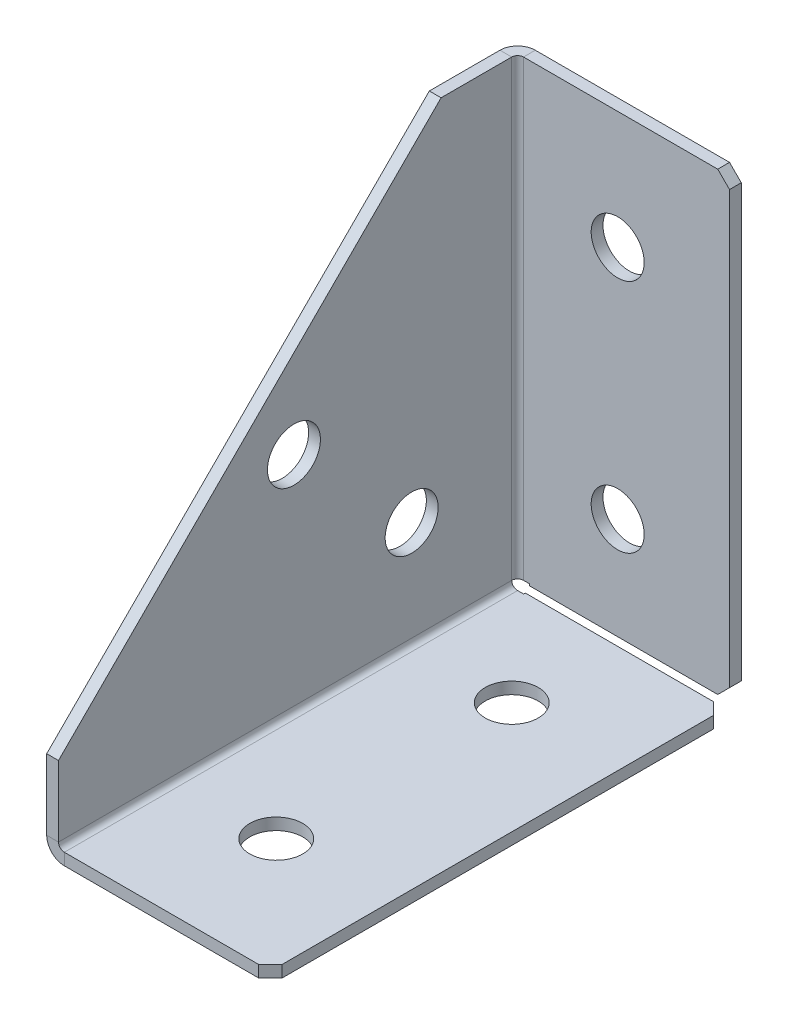
ISO-10303-21;
HEADER;
FILE_DESCRIPTION(('STEP AP214'),'2;1');
FILE_NAME('part.step','',(''),(''),'','','');
FILE_SCHEMA(('AUTOMOTIVE_DESIGN { 1 0 10303 214 1 1 1 1 }'));
ENDSEC;
DATA;
#1=APPLICATION_CONTEXT('core data for automotive mechanical design processes');
#2=APPLICATION_PROTOCOL_DEFINITION('international standard','automotive_design',2000,#1);
#3=PRODUCT_CONTEXT('',#1,'mechanical');
#4=PRODUCT('Part','Part','',(#3));
#5=PRODUCT_RELATED_PRODUCT_CATEGORY('part','',(#4));
#6=PRODUCT_DEFINITION_FORMATION('','',#4);
#7=PRODUCT_DEFINITION_CONTEXT('part definition',#1,'design');
#8=PRODUCT_DEFINITION('design','',#6,#7);
#9=PRODUCT_DEFINITION_SHAPE('','',#8);
#10=(LENGTH_UNIT() NAMED_UNIT(*) SI_UNIT(.MILLI.,.METRE.));
#11=(NAMED_UNIT(*) PLANE_ANGLE_UNIT() SI_UNIT($,.RADIAN.));
#12=(NAMED_UNIT(*) SI_UNIT($,.STERADIAN.) SOLID_ANGLE_UNIT());
#13=UNCERTAINTY_MEASURE_WITH_UNIT(LENGTH_MEASURE(1.E-05),#10,'distance_accuracy_value','');
#14=(GEOMETRIC_REPRESENTATION_CONTEXT(3) GLOBAL_UNCERTAINTY_ASSIGNED_CONTEXT((#13)) GLOBAL_UNIT_ASSIGNED_CONTEXT((#10,
#11,#12)) REPRESENTATION_CONTEXT('',''));
#15=CARTESIAN_POINT('',(0.,0.,0.));
#16=DIRECTION('',(0.,0.,1.));
#17=DIRECTION('',(1.,0.,0.));
#18=AXIS2_PLACEMENT_3D('',#15,#16,#17);
#19=CARTESIAN_POINT('',(3.,3.,2.99999999999998));
#20=DIRECTION('',(0.,0.,1.));
#21=DIRECTION('',(1.,0.,0.));
#22=AXIS2_PLACEMENT_3D('',#19,#20,#21);
#23=PLANE('',#22);
#24=DIRECTION('',(-1.,0.,0.));
#25=VECTOR('',#24,1.);
#26=CARTESIAN_POINT('',(0.,2.99999999999998,2.99999999999998));
#27=LINE('',#26,#25);
#28=CARTESIAN_POINT('',(2.,2.99999999999998,2.99999999999999));
#29=VERTEX_POINT('',#28);
#30=CARTESIAN_POINT('',(0.,2.99999999999998,2.99999999999998));
#31=VERTEX_POINT('',#30);
#32=EDGE_CURVE('E402',#29,#31,#27,.T.);
#33=ORIENTED_EDGE('',*,*,#32,.F.);
#34=CARTESIAN_POINT('',(3.,3.,2.99999999999998));
#35=DIRECTION('',(0.,0.,-1.));
#36=DIRECTION('',(-1.,0.,0.));
#37=AXIS2_PLACEMENT_3D('',#34,#35,#36);
#38=CIRCLE('',#37,1.);
#39=CARTESIAN_POINT('',(3.,2.,2.99999999999998));
#40=VERTEX_POINT('',#39);
#41=EDGE_CURVE('E347',#29,#40,#38,.F.);
#42=ORIENTED_EDGE('',*,*,#41,.T.);
#43=DIRECTION('',(0.,-1.,0.));
#44=VECTOR('',#43,1.);
#45=CARTESIAN_POINT('',(3.,0.,2.99999999999998));
#46=LINE('',#45,#44);
#47=CARTESIAN_POINT('',(3.,0.,2.99999999999998));
#48=VERTEX_POINT('',#47);
#49=EDGE_CURVE('E399',#40,#48,#46,.T.);
#50=ORIENTED_EDGE('',*,*,#49,.T.);
#51=CARTESIAN_POINT('',(3.,3.,2.99999999999998));
#52=DIRECTION('',(0.,0.,-1.));
#53=DIRECTION('',(-1.,0.,0.));
#54=AXIS2_PLACEMENT_3D('',#51,#52,#53);
#55=CIRCLE('',#54,3.);
#56=EDGE_CURVE('E286',#31,#48,#55,.F.);
#57=ORIENTED_EDGE('',*,*,#56,.F.);
#58=EDGE_LOOP('',(#33,#42,#50,#57));
#59=FACE_BOUND('',#58,.T.);
#60=ADVANCED_FACE('F48',(#59),#23,.F.);
#61=CARTESIAN_POINT('',(38.,0.,2.99999999999998));
#62=DIRECTION('',(0.,0.,1.));
#63=DIRECTION('',(1.,0.,0.));
#64=AXIS2_PLACEMENT_3D('',#61,#62,#63);
#65=PLANE('',#64);
#66=ORIENTED_EDGE('',*,*,#49,.F.);
#67=DIRECTION('',(1.,0.,0.));
#68=VECTOR('',#67,1.);
#69=CARTESIAN_POINT('',(38.,2.,2.99999999999998));
#70=LINE('',#69,#68);
#71=CARTESIAN_POINT('',(4.010301,2.,2.99999999999998));
#72=VERTEX_POINT('',#71);
#73=EDGE_CURVE('E317',#40,#72,#70,.T.);
#74=ORIENTED_EDGE('',*,*,#73,.T.);
#75=DIRECTION('',(0.,-1.,0.));
#76=VECTOR('',#75,1.);
#77=CARTESIAN_POINT('',(4.010301,0.,2.99999999999998));
#78=LINE('',#77,#76);
#79=CARTESIAN_POINT('',(4.010301,0.,2.99999999999998));
#80=VERTEX_POINT('',#79);
#81=EDGE_CURVE('E396',#72,#80,#78,.T.);
#82=ORIENTED_EDGE('',*,*,#81,.T.);
#83=DIRECTION('',(1.,0.,0.));
#84=VECTOR('',#83,1.);
#85=CARTESIAN_POINT('',(38.,0.,2.99999999999998));
#86=LINE('',#85,#84);
#87=EDGE_CURVE('E250',#48,#80,#86,.T.);
#88=ORIENTED_EDGE('',*,*,#87,.F.);
#89=EDGE_LOOP('',(#66,#74,#82,#88));
#90=FACE_BOUND('',#89,.T.);
#91=ADVANCED_FACE('F520',(#90),#65,.F.);
#92=CARTESIAN_POINT('',(4.010301,0.,80.));
#93=DIRECTION('',(-1.,0.,0.));
#94=DIRECTION('',(0.,0.,1.));
#95=AXIS2_PLACEMENT_3D('',#92,#93,#94);
#96=PLANE('',#95);
#97=ORIENTED_EDGE('',*,*,#81,.F.);
#98=DIRECTION('',(0.,0.,1.));
#99=VECTOR('',#98,1.);
#100=CARTESIAN_POINT('',(4.010301,2.,80.));
#101=LINE('',#100,#99);
#102=CARTESIAN_POINT('',(4.010301,2.,2.70710678118655));
#103=VERTEX_POINT('',#102);
#104=EDGE_CURVE('E357',#103,#72,#101,.T.);
#105=ORIENTED_EDGE('',*,*,#104,.F.);
#106=DIRECTION('',(0.,-1.,0.));
#107=VECTOR('',#106,1.);
#108=CARTESIAN_POINT('',(4.010301,0.,2.70710678118655));
#109=LINE('',#108,#107);
#110=CARTESIAN_POINT('',(4.010301,0.,2.70710678118655));
#111=VERTEX_POINT('',#110);
#112=EDGE_CURVE('E393',#103,#111,#109,.T.);
#113=ORIENTED_EDGE('',*,*,#112,.T.);
#114=DIRECTION('',(0.,0.,1.));
#115=VECTOR('',#114,1.);
#116=CARTESIAN_POINT('',(4.010301,0.,80.));
#117=LINE('',#116,#115);
#118=EDGE_CURVE('E246',#111,#80,#117,.T.);
#119=ORIENTED_EDGE('',*,*,#118,.T.);
#120=EDGE_LOOP('',(#97,#105,#113,#119));
#121=FACE_BOUND('',#120,.T.);
#122=ADVANCED_FACE('F525',(#121),#96,.T.);
#123=CARTESIAN_POINT('',(38.,0.,2.70710678118655));
#124=DIRECTION('',(0.,0.,1.));
#125=DIRECTION('',(1.,0.,0.));
#126=AXIS2_PLACEMENT_3D('',#123,#124,#125);
#127=PLANE('',#126);
#128=DIRECTION('',(1.,0.,0.));
#129=VECTOR('',#128,1.);
#130=CARTESIAN_POINT('',(38.,2.,2.70710678118655));
#131=LINE('',#130,#129);
#132=CARTESIAN_POINT('',(36.,2.,2.70710678118655));
#133=VERTEX_POINT('',#132);
#134=EDGE_CURVE('E321',#103,#133,#131,.T.);
#135=ORIENTED_EDGE('',*,*,#134,.T.);
#136=DIRECTION('',(0.,1.,0.));
#137=VECTOR('',#136,1.);
#138=CARTESIAN_POINT('',(36.,0.,2.70710678118655));
#139=LINE('',#138,#137);
#140=CARTESIAN_POINT('',(36.,0.,2.70710678118655));
#141=VERTEX_POINT('',#140);
#142=EDGE_CURVE('E429',#133,#141,#139,.F.);
#143=ORIENTED_EDGE('',*,*,#142,.T.);
#144=DIRECTION('',(1.,0.,0.));
#145=VECTOR('',#144,1.);
#146=CARTESIAN_POINT('',(38.,0.,2.70710678118655));
#147=LINE('',#146,#145);
#148=EDGE_CURVE('E242',#111,#141,#147,.T.);
#149=ORIENTED_EDGE('',*,*,#148,.F.);
#150=ORIENTED_EDGE('',*,*,#112,.F.);
#151=EDGE_LOOP('',(#135,#143,#149,#150));
#152=FACE_BOUND('',#151,.T.);
#153=ADVANCED_FACE('F562',(#152),#127,.F.);
#154=CARTESIAN_POINT('',(38.,0.,80.));
#155=DIRECTION('',(1.,0.,0.));
#156=DIRECTION('',(0.,0.,-1.));
#157=AXIS2_PLACEMENT_3D('',#154,#155,#156);
#158=PLANE('',#157);
#159=DIRECTION('',(0.,0.,1.));
#160=VECTOR('',#159,1.);
#161=CARTESIAN_POINT('',(38.,2.,80.));
#162=LINE('',#161,#160);
#163=CARTESIAN_POINT('',(38.,2.,78.));
#164=VERTEX_POINT('',#163);
#165=CARTESIAN_POINT('',(38.,2.,4.70710678118656));
#166=VERTEX_POINT('',#165);
#167=EDGE_CURVE('E350',#164,#166,#162,.F.);
#168=ORIENTED_EDGE('',*,*,#167,.F.);
#169=DIRECTION('',(0.,-1.,0.));
#170=VECTOR('',#169,1.);
#171=CARTESIAN_POINT('',(38.,0.,78.));
#172=LINE('',#171,#170);
#173=CARTESIAN_POINT('',(38.,0.,78.));
#174=VERTEX_POINT('',#173);
#175=EDGE_CURVE('E410',#164,#174,#172,.T.);
#176=ORIENTED_EDGE('',*,*,#175,.T.);
#177=DIRECTION('',(0.,0.,-1.));
#178=VECTOR('',#177,1.);
#179=CARTESIAN_POINT('',(38.,0.,80.));
#180=LINE('',#179,#178);
#181=CARTESIAN_POINT('',(38.,0.,4.70710678118656));
#182=VERTEX_POINT('',#181);
#183=EDGE_CURVE('E279',#174,#182,#180,.T.);
#184=ORIENTED_EDGE('',*,*,#183,.T.);
#185=DIRECTION('',(0.,1.,0.));
#186=VECTOR('',#185,1.);
#187=CARTESIAN_POINT('',(38.,0.,4.70710678118656));
#188=LINE('',#187,#186);
#189=EDGE_CURVE('E405',#182,#166,#188,.T.);
#190=ORIENTED_EDGE('',*,*,#189,.T.);
#191=EDGE_LOOP('',(#168,#176,#184,#190));
#192=FACE_BOUND('',#191,.T.);
#193=ADVANCED_FACE('F576',(#192),#158,.T.);
#194=CARTESIAN_POINT('',(38.,0.,80.));
#195=DIRECTION('',(0.,0.,-1.));
#196=DIRECTION('',(-1.,0.,0.));
#197=AXIS2_PLACEMENT_3D('',#194,#195,#196);
#198=PLANE('',#197);
#199=DIRECTION('',(-1.,0.,0.));
#200=VECTOR('',#199,1.);
#201=CARTESIAN_POINT('',(38.,0.,80.));
#202=LINE('',#201,#200);
#203=CARTESIAN_POINT('',(36.,0.,80.));
#204=VERTEX_POINT('',#203);
#205=CARTESIAN_POINT('',(3.,0.,80.));
#206=VERTEX_POINT('',#205);
#207=EDGE_CURVE('E220',#204,#206,#202,.T.);
#208=ORIENTED_EDGE('',*,*,#207,.F.);
#209=DIRECTION('',(0.,-1.,0.));
#210=VECTOR('',#209,1.);
#211=CARTESIAN_POINT('',(36.,0.,80.));
#212=LINE('',#211,#210);
#213=CARTESIAN_POINT('',(36.,2.,80.));
#214=VERTEX_POINT('',#213);
#215=EDGE_CURVE('E420',#204,#214,#212,.F.);
#216=ORIENTED_EDGE('',*,*,#215,.T.);
#217=DIRECTION('',(1.,0.,0.));
#218=VECTOR('',#217,1.);
#219=CARTESIAN_POINT('',(38.,2.,80.));
#220=LINE('',#219,#218);
#221=CARTESIAN_POINT('',(3.,2.,80.));
#222=VERTEX_POINT('',#221);
#223=EDGE_CURVE('E343',#214,#222,#220,.F.);
#224=ORIENTED_EDGE('',*,*,#223,.T.);
#225=DIRECTION('',(0.,-1.,0.));
#226=VECTOR('',#225,1.);
#227=CARTESIAN_POINT('',(3.,0.,80.));
#228=LINE('',#227,#226);
#229=EDGE_CURVE('E389',#222,#206,#228,.T.);
#230=ORIENTED_EDGE('',*,*,#229,.T.);
#231=EDGE_LOOP('',(#208,#216,#224,#230));
#232=FACE_BOUND('',#231,.T.);
#233=ADVANCED_FACE('F714',(#232),#198,.F.);
#234=CARTESIAN_POINT('',(3.,3.,80.));
#235=DIRECTION('',(0.,0.,1.));
#236=DIRECTION('',(1.,0.,0.));
#237=AXIS2_PLACEMENT_3D('',#234,#235,#236);
#238=PLANE('',#237);
#239=ORIENTED_EDGE('',*,*,#229,.F.);
#240=CARTESIAN_POINT('',(3.,3.,80.));
#241=DIRECTION('',(0.,0.,-1.));
#242=DIRECTION('',(-1.,0.,0.));
#243=AXIS2_PLACEMENT_3D('',#240,#241,#242);
#244=CIRCLE('',#243,1.);
#245=CARTESIAN_POINT('',(2.,3.,80.));
#246=VERTEX_POINT('',#245);
#247=EDGE_CURVE('E334',#222,#246,#244,.T.);
#248=ORIENTED_EDGE('',*,*,#247,.T.);
#249=DIRECTION('',(-1.,0.,0.));
#250=VECTOR('',#249,1.);
#251=CARTESIAN_POINT('',(0.,3.,80.));
#252=LINE('',#251,#250);
#253=CARTESIAN_POINT('',(0.,3.,80.));
#254=VERTEX_POINT('',#253);
#255=EDGE_CURVE('E207',#246,#254,#252,.T.);
#256=ORIENTED_EDGE('',*,*,#255,.T.);
#257=CARTESIAN_POINT('',(3.,3.,80.));
#258=DIRECTION('',(0.,0.,-1.));
#259=DIRECTION('',(-1.,0.,0.));
#260=AXIS2_PLACEMENT_3D('',#257,#258,#259);
#261=CIRCLE('',#260,3.);
#262=EDGE_CURVE('E275',#206,#254,#261,.T.);
#263=ORIENTED_EDGE('',*,*,#262,.F.);
#264=EDGE_LOOP('',(#239,#248,#256,#263));
#265=FACE_BOUND('',#264,.T.);
#266=ADVANCED_FACE('F493',(#265),#238,.T.);
#267=CARTESIAN_POINT('',(0.,15.,80.));
#268=DIRECTION('',(0.,0.,1.));
#269=DIRECTION('',(0.,-1.,0.));
#270=AXIS2_PLACEMENT_3D('',#267,#268,#269);
#271=PLANE('',#270);
#272=ORIENTED_EDGE('',*,*,#255,.F.);
#273=DIRECTION('',(0.,1.,0.));
#274=VECTOR('',#273,1.);
#275=CARTESIAN_POINT('',(2.,0.,80.));
#276=LINE('',#275,#274);
#277=CARTESIAN_POINT('',(2.,15.,80.));
#278=VERTEX_POINT('',#277);
#279=EDGE_CURVE('E201',#278,#246,#276,.F.);
#280=ORIENTED_EDGE('',*,*,#279,.F.);
#281=DIRECTION('',(-1.,0.,0.));
#282=VECTOR('',#281,1.);
#283=CARTESIAN_POINT('',(0.,15.,80.));
#284=LINE('',#283,#282);
#285=CARTESIAN_POINT('',(0.,15.,80.));
#286=VERTEX_POINT('',#285);
#287=EDGE_CURVE('E195',#278,#286,#284,.T.);
#288=ORIENTED_EDGE('',*,*,#287,.T.);
#289=DIRECTION('',(0.,-1.,0.));
#290=VECTOR('',#289,1.);
#291=CARTESIAN_POINT('',(0.,15.,80.));
#292=LINE('',#291,#290);
#293=EDGE_CURVE('E198',#286,#254,#292,.T.);
#294=ORIENTED_EDGE('',*,*,#293,.T.);
#295=EDGE_LOOP('',(#272,#280,#288,#294));
#296=FACE_BOUND('',#295,.T.);
#297=ADVANCED_FACE('F197',(#296),#271,.T.);
#298=CARTESIAN_POINT('',(0.,80.,15.));
#299=DIRECTION('',(0.,0.707106781186548,0.707106781186548));
#300=DIRECTION('',(0.,-0.707106781186547,0.707106781186547));
#301=AXIS2_PLACEMENT_3D('',#298,#299,#300);
#302=PLANE('',#301);
#303=ORIENTED_EDGE('',*,*,#287,.F.);
#304=DIRECTION('',(0.,-0.707106781186547,0.707106781186547));
#305=VECTOR('',#304,1.);
#306=CARTESIAN_POINT('',(2.,80.,15.));
#307=LINE('',#306,#305);
#308=CARTESIAN_POINT('',(2.,80.,15.));
#309=VERTEX_POINT('',#308);
#310=EDGE_CURVE('E338',#309,#278,#307,.T.);
#311=ORIENTED_EDGE('',*,*,#310,.F.);
#312=DIRECTION('',(-1.,0.,0.));
#313=VECTOR('',#312,1.);
#314=CARTESIAN_POINT('',(0.,80.,15.));
#315=LINE('',#314,#313);
#316=CARTESIAN_POINT('',(0.,80.,15.));
#317=VERTEX_POINT('',#316);
#318=EDGE_CURVE('E208',#309,#317,#315,.T.);
#319=ORIENTED_EDGE('',*,*,#318,.T.);
#320=DIRECTION('',(0.,-0.707106781186547,0.707106781186547));
#321=VECTOR('',#320,1.);
#322=CARTESIAN_POINT('',(0.,80.,15.));
#323=LINE('',#322,#321);
#324=EDGE_CURVE('E215',#317,#286,#323,.T.);
#325=ORIENTED_EDGE('',*,*,#324,.T.);
#326=EDGE_LOOP('',(#303,#311,#319,#325));
#327=FACE_BOUND('',#326,.T.);
#328=ADVANCED_FACE('F222',(#327),#302,.T.);
#329=CARTESIAN_POINT('',(0.,80.,0.));
#330=DIRECTION('',(0.,1.,0.));
#331=DIRECTION('',(0.,0.,1.));
#332=AXIS2_PLACEMENT_3D('',#329,#330,#331);
#333=PLANE('',#332);
#334=ORIENTED_EDGE('',*,*,#318,.F.);
#335=DIRECTION('',(0.,0.,-1.));
#336=VECTOR('',#335,1.);
#337=CARTESIAN_POINT('',(2.,80.,0.));
#338=LINE('',#337,#336);
#339=CARTESIAN_POINT('',(2.,80.,3.));
#340=VERTEX_POINT('',#339);
#341=EDGE_CURVE('E328',#340,#309,#338,.F.);
#342=ORIENTED_EDGE('',*,*,#341,.F.);
#343=DIRECTION('',(-1.,0.,0.));
#344=VECTOR('',#343,1.);
#345=CARTESIAN_POINT('',(0.,80.,3.));
#346=LINE('',#345,#344);
#347=CARTESIAN_POINT('',(0.,80.,3.));
#348=VERTEX_POINT('',#347);
#349=EDGE_CURVE('E382',#340,#348,#346,.T.);
#350=ORIENTED_EDGE('',*,*,#349,.T.);
#351=DIRECTION('',(0.,0.,1.));
#352=VECTOR('',#351,1.);
#353=CARTESIAN_POINT('',(0.,80.,0.));
#354=LINE('',#353,#352);
#355=EDGE_CURVE('E224',#348,#317,#354,.T.);
#356=ORIENTED_EDGE('',*,*,#355,.T.);
#357=EDGE_LOOP('',(#334,#342,#350,#356));
#358=FACE_BOUND('',#357,.T.);
#359=ADVANCED_FACE('F505',(#358),#333,.T.);
#360=CARTESIAN_POINT('',(3.,80.,3.));
#361=DIRECTION('',(0.,-1.,0.));
#362=DIRECTION('',(0.,0.,-1.));
#363=AXIS2_PLACEMENT_3D('',#360,#361,#362);
#364=PLANE('',#363);
#365=ORIENTED_EDGE('',*,*,#349,.F.);
#366=CARTESIAN_POINT('',(3.,80.,3.));
#367=DIRECTION('',(0.,1.,0.));
#368=DIRECTION('',(0.,0.,1.));
#369=AXIS2_PLACEMENT_3D('',#366,#367,#368);
#370=CIRCLE('',#369,1.);
#371=CARTESIAN_POINT('',(3.,80.,2.));
#372=VERTEX_POINT('',#371);
#373=EDGE_CURVE('E329',#340,#372,#370,.F.);
#374=ORIENTED_EDGE('',*,*,#373,.T.);
#375=DIRECTION('',(0.,0.,-1.));
#376=VECTOR('',#375,1.);
#377=CARTESIAN_POINT('',(3.,80.,0.));
#378=LINE('',#377,#376);
#379=CARTESIAN_POINT('',(3.,80.,0.));
#380=VERTEX_POINT('',#379);
#381=EDGE_CURVE('E378',#372,#380,#378,.T.);
#382=ORIENTED_EDGE('',*,*,#381,.T.);
#383=CARTESIAN_POINT('',(3.,80.,3.));
#384=DIRECTION('',(0.,1.,0.));
#385=DIRECTION('',(0.,0.,1.));
#386=AXIS2_PLACEMENT_3D('',#383,#384,#385);
#387=CIRCLE('',#386,3.);
#388=EDGE_CURVE('E270',#348,#380,#387,.F.);
#389=ORIENTED_EDGE('',*,*,#388,.F.);
#390=EDGE_LOOP('',(#365,#374,#382,#389));
#391=FACE_BOUND('',#390,.T.);
#392=ADVANCED_FACE('F507',(#391),#364,.F.);
#393=CARTESIAN_POINT('',(38.,80.,0.));
#394=DIRECTION('',(0.,1.,0.));
#395=DIRECTION('',(-1.,0.,0.));
#396=AXIS2_PLACEMENT_3D('',#393,#394,#395);
#397=PLANE('',#396);
#398=DIRECTION('',(1.,0.,0.));
#399=VECTOR('',#398,1.);
#400=CARTESIAN_POINT('',(38.,80.,2.));
#401=LINE('',#400,#399);
#402=CARTESIAN_POINT('',(36.,80.,2.));
#403=VERTEX_POINT('',#402);
#404=EDGE_CURVE('E325',#403,#372,#401,.F.);
#405=ORIENTED_EDGE('',*,*,#404,.F.);
#406=DIRECTION('',(0.,0.,-1.));
#407=VECTOR('',#406,1.);
#408=CARTESIAN_POINT('',(36.,80.,0.));
#409=LINE('',#408,#407);
#410=CARTESIAN_POINT('',(36.,80.,0.));
#411=VERTEX_POINT('',#410);
#412=EDGE_CURVE('E11',#403,#411,#409,.T.);
#413=ORIENTED_EDGE('',*,*,#412,.T.);
#414=DIRECTION('',(-1.,0.,0.));
#415=VECTOR('',#414,1.);
#416=CARTESIAN_POINT('',(38.,80.,0.));
#417=LINE('',#416,#415);
#418=EDGE_CURVE('E229',#411,#380,#417,.T.);
#419=ORIENTED_EDGE('',*,*,#418,.T.);
#420=ORIENTED_EDGE('',*,*,#381,.F.);
#421=EDGE_LOOP('',(#405,#413,#419,#420));
#422=FACE_BOUND('',#421,.T.);
#423=ADVANCED_FACE('F511',(#422),#397,.T.);
#424=CARTESIAN_POINT('',(38.,0.,0.));
#425=DIRECTION('',(1.,0.,0.));
#426=DIRECTION('',(0.,1.,0.));
#427=AXIS2_PLACEMENT_3D('',#424,#425,#426);
#428=PLANE('',#427);
#429=DIRECTION('',(0.,1.,0.));
#430=VECTOR('',#429,1.);
#431=CARTESIAN_POINT('',(38.,0.,2.));
#432=LINE('',#431,#430);
#433=CARTESIAN_POINT('',(38.,4.70710678118655,2.));
#434=VERTEX_POINT('',#433);
#435=CARTESIAN_POINT('',(38.,78.,2.));
#436=VERTEX_POINT('',#435);
#437=EDGE_CURVE('E322',#434,#436,#432,.T.);
#438=ORIENTED_EDGE('',*,*,#437,.F.);
#439=DIRECTION('',(0.,0.,-1.));
#440=VECTOR('',#439,1.);
#441=CARTESIAN_POINT('',(38.,4.70710678118655,0.));
#442=LINE('',#441,#440);
#443=CARTESIAN_POINT('',(38.,4.70710678118655,0.));
#444=VERTEX_POINT('',#443);
#445=EDGE_CURVE('E436',#434,#444,#442,.T.);
#446=ORIENTED_EDGE('',*,*,#445,.T.);
#447=DIRECTION('',(0.,1.,0.));
#448=VECTOR('',#447,1.);
#449=CARTESIAN_POINT('',(38.,0.,0.));
#450=LINE('',#449,#448);
#451=CARTESIAN_POINT('',(38.,78.,0.));
#452=VERTEX_POINT('',#451);
#453=EDGE_CURVE('E235',#444,#452,#450,.T.);
#454=ORIENTED_EDGE('',*,*,#453,.T.);
#455=DIRECTION('',(0.,0.,1.));
#456=VECTOR('',#455,1.);
#457=CARTESIAN_POINT('',(38.,78.,0.));
#458=LINE('',#457,#456);
#459=EDGE_CURVE('E433',#452,#436,#458,.T.);
#460=ORIENTED_EDGE('',*,*,#459,.T.);
#461=EDGE_LOOP('',(#438,#446,#454,#460));
#462=FACE_BOUND('',#461,.T.);
#463=ADVANCED_FACE('F458',(#462),#428,.T.);
#464=CARTESIAN_POINT('',(38.,2.70710678118655,0.));
#465=DIRECTION('',(0.,1.,0.));
#466=DIRECTION('',(-1.,0.,0.));
#467=AXIS2_PLACEMENT_3D('',#464,#465,#466);
#468=PLANE('',#467);
#469=DIRECTION('',(-1.,0.,0.));
#470=VECTOR('',#469,1.);
#471=CARTESIAN_POINT('',(38.,2.70710678118655,0.));
#472=LINE('',#471,#470);
#473=CARTESIAN_POINT('',(36.,2.70710678118655,0.));
#474=VERTEX_POINT('',#473);
#475=CARTESIAN_POINT('',(4.010301,2.70710678118655,0.));
#476=VERTEX_POINT('',#475);
#477=EDGE_CURVE('E239',#474,#476,#472,.T.);
#478=ORIENTED_EDGE('',*,*,#477,.F.);
#479=DIRECTION('',(0.,0.,-1.));
#480=VECTOR('',#479,1.);
#481=CARTESIAN_POINT('',(36.,2.70710678118655,0.));
#482=LINE('',#481,#480);
#483=CARTESIAN_POINT('',(36.,2.70710678118655,2.));
#484=VERTEX_POINT('',#483);
#485=EDGE_CURVE('E73',#474,#484,#482,.F.);
#486=ORIENTED_EDGE('',*,*,#485,.T.);
#487=DIRECTION('',(1.,0.,0.));
#488=VECTOR('',#487,1.);
#489=CARTESIAN_POINT('',(38.,2.70710678118655,2.));
#490=LINE('',#489,#488);
#491=CARTESIAN_POINT('',(4.010301,2.70710678118655,2.));
#492=VERTEX_POINT('',#491);
#493=EDGE_CURVE('E318',#484,#492,#490,.F.);
#494=ORIENTED_EDGE('',*,*,#493,.T.);
#495=DIRECTION('',(0.,0.,-1.));
#496=VECTOR('',#495,1.);
#497=CARTESIAN_POINT('',(4.010301,2.70710678118655,0.));
#498=LINE('',#497,#496);
#499=EDGE_CURVE('E374',#492,#476,#498,.T.);
#500=ORIENTED_EDGE('',*,*,#499,.T.);
#501=EDGE_LOOP('',(#478,#486,#494,#500));
#502=FACE_BOUND('',#501,.T.);
#503=ADVANCED_FACE('F465',(#502),#468,.F.);
#504=CARTESIAN_POINT('',(4.010301,0.,0.));
#505=DIRECTION('',(-1.,0.,0.));
#506=DIRECTION('',(0.,-1.,0.));
#507=AXIS2_PLACEMENT_3D('',#504,#505,#506);
#508=PLANE('',#507);
#509=ORIENTED_EDGE('',*,*,#499,.F.);
#510=DIRECTION('',(0.,1.,0.));
#511=VECTOR('',#510,1.);
#512=CARTESIAN_POINT('',(4.010301,0.,2.));
#513=LINE('',#512,#511);
#514=CARTESIAN_POINT('',(4.010301,2.99999999999998,2.));
#515=VERTEX_POINT('',#514);
#516=EDGE_CURVE('E313',#515,#492,#513,.F.);
#517=ORIENTED_EDGE('',*,*,#516,.F.);
#518=DIRECTION('',(0.,0.,-1.));
#519=VECTOR('',#518,1.);
#520=CARTESIAN_POINT('',(4.010301,2.99999999999998,0.));
#521=LINE('',#520,#519);
#522=CARTESIAN_POINT('',(4.010301,2.99999999999998,0.));
#523=VERTEX_POINT('',#522);
#524=EDGE_CURVE('E371',#515,#523,#521,.T.);
#525=ORIENTED_EDGE('',*,*,#524,.T.);
#526=DIRECTION('',(0.,-1.,0.));
#527=VECTOR('',#526,1.);
#528=CARTESIAN_POINT('',(4.010301,0.,0.));
#529=LINE('',#528,#527);
#530=EDGE_CURVE('E254',#523,#476,#529,.T.);
#531=ORIENTED_EDGE('',*,*,#530,.T.);
#532=EDGE_LOOP('',(#509,#517,#525,#531));
#533=FACE_BOUND('',#532,.T.);
#534=ADVANCED_FACE('F469',(#533),#508,.T.);
#535=CARTESIAN_POINT('',(38.,2.99999999999998,0.));
#536=DIRECTION('',(0.,1.,0.));
#537=DIRECTION('',(-1.,0.,0.));
#538=AXIS2_PLACEMENT_3D('',#535,#536,#537);
#539=PLANE('',#538);
#540=ORIENTED_EDGE('',*,*,#524,.F.);
#541=DIRECTION('',(1.,0.,0.));
#542=VECTOR('',#541,1.);
#543=CARTESIAN_POINT('',(38.,2.99999999999998,2.));
#544=LINE('',#543,#542);
#545=CARTESIAN_POINT('',(3.,2.99999999999998,2.));
#546=VERTEX_POINT('',#545);
#547=EDGE_CURVE('E299',#515,#546,#544,.F.);
#548=ORIENTED_EDGE('',*,*,#547,.T.);
#549=DIRECTION('',(0.,0.,-1.));
#550=VECTOR('',#549,1.);
#551=CARTESIAN_POINT('',(3.,2.99999999999998,0.));
#552=LINE('',#551,#550);
#553=CARTESIAN_POINT('',(3.,2.99999999999998,0.));
#554=VERTEX_POINT('',#553);
#555=EDGE_CURVE('E285',#546,#554,#552,.T.);
#556=ORIENTED_EDGE('',*,*,#555,.T.);
#557=DIRECTION('',(-1.,0.,0.));
#558=VECTOR('',#557,1.);
#559=CARTESIAN_POINT('',(38.,2.99999999999998,0.));
#560=LINE('',#559,#558);
#561=EDGE_CURVE('E258',#523,#554,#560,.T.);
#562=ORIENTED_EDGE('',*,*,#561,.F.);
#563=EDGE_LOOP('',(#540,#548,#556,#562));
#564=FACE_BOUND('',#563,.T.);
#565=ADVANCED_FACE('F473',(#564),#539,.F.);
#566=CARTESIAN_POINT('',(3.,2.99999999999998,3.));
#567=DIRECTION('',(0.,1.,0.));
#568=DIRECTION('',(0.,0.,1.));
#569=AXIS2_PLACEMENT_3D('',#566,#567,#568);
#570=PLANE('',#569);
#571=CARTESIAN_POINT('',(3.,2.99999999999998,3.));
#572=DIRECTION('',(0.,1.,0.));
#573=DIRECTION('',(0.,0.,1.));
#574=AXIS2_PLACEMENT_3D('',#571,#572,#573);
#575=CIRCLE('',#574,1.);
#576=EDGE_CURVE('E333',#546,#29,#575,.T.);
#577=ORIENTED_EDGE('',*,*,#576,.T.);
#578=ORIENTED_EDGE('',*,*,#32,.T.);
#579=CARTESIAN_POINT('',(3.,2.99999999999998,3.));
#580=DIRECTION('',(0.,-1.,0.));
#581=DIRECTION('',(0.,0.,-1.));
#582=AXIS2_PLACEMENT_3D('',#579,#580,#581);
#583=CIRCLE('',#582,3.);
#584=EDGE_CURVE('E274',#554,#31,#583,.F.);
#585=ORIENTED_EDGE('',*,*,#584,.F.);
#586=ORIENTED_EDGE('',*,*,#555,.F.);
#587=EDGE_LOOP('',(#577,#578,#585,#586));
#588=FACE_BOUND('',#587,.T.);
#589=ADVANCED_FACE('F478',(#588),#570,.F.);
#590=CARTESIAN_POINT('',(38.,0.,0.));
#591=DIRECTION('',(0.,0.,1.));
#592=DIRECTION('',(1.,0.,0.));
#593=AXIS2_PLACEMENT_3D('',#590,#591,#592);
#594=PLANE('',#593);
#595=CARTESIAN_POINT('',(19.,60.,0.));
#596=DIRECTION('',(0.,0.,1.));
#597=DIRECTION('',(1.,0.,0.));
#598=AXIS2_PLACEMENT_3D('',#595,#596,#597);
#599=CIRCLE('',#598,4.5);
#600=CARTESIAN_POINT('',(23.5,60.,0.));
#601=VERTEX_POINT('',#600);
#602=EDGE_CURVE('E591',#601,#601,#599,.T.);
#603=ORIENTED_EDGE('',*,*,#602,.T.);
#604=EDGE_LOOP('',(#603));
#605=FACE_BOUND('',#604,.T.);
#606=CARTESIAN_POINT('',(19.,20.,0.));
#607=DIRECTION('',(0.,0.,1.));
#608=DIRECTION('',(1.,0.,0.));
#609=AXIS2_PLACEMENT_3D('',#606,#607,#608);
#610=CIRCLE('',#609,4.5);
#611=CARTESIAN_POINT('',(23.5,20.,0.));
#612=VERTEX_POINT('',#611);
#613=EDGE_CURVE('E367',#612,#612,#610,.T.);
#614=ORIENTED_EDGE('',*,*,#613,.T.);
#615=EDGE_LOOP('',(#614));
#616=FACE_BOUND('',#615,.T.);
#617=ORIENTED_EDGE('',*,*,#453,.F.);
#618=DIRECTION('',(-0.70710678118655,-0.707106781186545,0.));
#619=VECTOR('',#618,1.);
#620=CARTESIAN_POINT('',(38.,4.70710678118655,0.));
#621=LINE('',#620,#619);
#622=EDGE_CURVE('E443',#444,#474,#621,.T.);
#623=ORIENTED_EDGE('',*,*,#622,.T.);
#624=ORIENTED_EDGE('',*,*,#477,.T.);
#625=ORIENTED_EDGE('',*,*,#530,.F.);
#626=ORIENTED_EDGE('',*,*,#561,.T.);
#627=DIRECTION('',(0.,1.,0.));
#628=VECTOR('',#627,1.);
#629=CARTESIAN_POINT('',(3.,0.,0.));
#630=LINE('',#629,#628);
#631=EDGE_CURVE('E262',#554,#380,#630,.T.);
#632=ORIENTED_EDGE('',*,*,#631,.T.);
#633=ORIENTED_EDGE('',*,*,#418,.F.);
#634=DIRECTION('',(-0.707106781186545,0.70710678118655,0.));
#635=VECTOR('',#634,1.);
#636=CARTESIAN_POINT('',(36.,80.,0.));
#637=LINE('',#636,#635);
#638=EDGE_CURVE('E440',#411,#452,#637,.F.);
#639=ORIENTED_EDGE('',*,*,#638,.T.);
#640=EDGE_LOOP('',(#617,#623,#624,#625,#626,#632,#633,#639));
#641=FACE_BOUND('',#640,.T.);
#642=ADVANCED_FACE('F463',(#605,#616,#641),#594,.F.);
#643=CARTESIAN_POINT('',(0.,0.,0.));
#644=DIRECTION('',(1.,0.,0.));
#645=DIRECTION('',(0.,0.,-1.));
#646=AXIS2_PLACEMENT_3D('',#643,#644,#645);
#647=PLANE('',#646);
#648=CARTESIAN_POINT('',(0.,40.,40.));
#649=DIRECTION('',(1.,0.,0.));
#650=DIRECTION('',(0.,0.,-1.));
#651=AXIS2_PLACEMENT_3D('',#648,#649,#650);
#652=CIRCLE('',#651,4.5);
#653=CARTESIAN_POINT('',(0.,40.,35.5));
#654=VERTEX_POINT('',#653);
#655=EDGE_CURVE('E620',#654,#654,#652,.T.);
#656=ORIENTED_EDGE('',*,*,#655,.T.);
#657=EDGE_LOOP('',(#656));
#658=FACE_BOUND('',#657,.T.);
#659=CARTESIAN_POINT('',(0.,20.,20.));
#660=DIRECTION('',(1.,0.,0.));
#661=DIRECTION('',(0.,0.,-1.));
#662=AXIS2_PLACEMENT_3D('',#659,#660,#661);
#663=CIRCLE('',#662,4.5);
#664=CARTESIAN_POINT('',(0.,20.,15.5));
#665=VERTEX_POINT('',#664);
#666=EDGE_CURVE('E615',#665,#665,#663,.T.);
#667=ORIENTED_EDGE('',*,*,#666,.T.);
#668=EDGE_LOOP('',(#667));
#669=FACE_BOUND('',#668,.T.);
#670=DIRECTION('',(0.,1.,0.));
#671=VECTOR('',#670,1.);
#672=CARTESIAN_POINT('',(0.,0.,3.));
#673=LINE('',#672,#671);
#674=EDGE_CURVE('E266',#348,#31,#673,.F.);
#675=ORIENTED_EDGE('',*,*,#674,.T.);
#676=DIRECTION('',(0.,0.,-1.));
#677=VECTOR('',#676,1.);
#678=CARTESIAN_POINT('',(0.,3.,0.));
#679=LINE('',#678,#677);
#680=EDGE_CURVE('E218',#31,#254,#679,.F.);
#681=ORIENTED_EDGE('',*,*,#680,.T.);
#682=ORIENTED_EDGE('',*,*,#293,.F.);
#683=ORIENTED_EDGE('',*,*,#324,.F.);
#684=ORIENTED_EDGE('',*,*,#355,.F.);
#685=EDGE_LOOP('',(#675,#681,#682,#683,#684));
#686=FACE_BOUND('',#685,.T.);
#687=ADVANCED_FACE('F213',(#658,#669,#686),#647,.F.);
#688=CARTESIAN_POINT('',(38.,0.,80.));
#689=DIRECTION('',(0.,1.,0.));
#690=DIRECTION('',(0.,0.,1.));
#691=AXIS2_PLACEMENT_3D('',#688,#689,#690);
#692=PLANE('',#691);
#693=CARTESIAN_POINT('',(19.,0.,60.));
#694=DIRECTION('',(0.,1.,0.));
#695=DIRECTION('',(0.,0.,1.));
#696=AXIS2_PLACEMENT_3D('',#693,#694,#695);
#697=CIRCLE('',#696,4.5);
#698=CARTESIAN_POINT('',(19.,0.,64.5));
#699=VERTEX_POINT('',#698);
#700=EDGE_CURVE('E607',#699,#699,#697,.T.);
#701=ORIENTED_EDGE('',*,*,#700,.T.);
#702=EDGE_LOOP('',(#701));
#703=FACE_BOUND('',#702,.T.);
#704=CARTESIAN_POINT('',(19.,0.,20.));
#705=DIRECTION('',(0.,1.,0.));
#706=DIRECTION('',(0.,0.,1.));
#707=AXIS2_PLACEMENT_3D('',#704,#705,#706);
#708=CIRCLE('',#707,4.5);
#709=CARTESIAN_POINT('',(19.,0.,24.5));
#710=VERTEX_POINT('',#709);
#711=EDGE_CURVE('E599',#710,#710,#708,.T.);
#712=ORIENTED_EDGE('',*,*,#711,.T.);
#713=EDGE_LOOP('',(#712));
#714=FACE_BOUND('',#713,.T.);
#715=ORIENTED_EDGE('',*,*,#183,.F.);
#716=DIRECTION('',(-0.707106781186552,0.,0.707106781186543));
#717=VECTOR('',#716,1.);
#718=CARTESIAN_POINT('',(38.,0.,78.));
#719=LINE('',#718,#717);
#720=EDGE_CURVE('E417',#174,#204,#719,.T.);
#721=ORIENTED_EDGE('',*,*,#720,.T.);
#722=ORIENTED_EDGE('',*,*,#207,.T.);
#723=DIRECTION('',(0.,0.,-1.));
#724=VECTOR('',#723,1.);
#725=CARTESIAN_POINT('',(3.,0.,80.));
#726=LINE('',#725,#724);
#727=EDGE_CURVE('E269',#206,#48,#726,.T.);
#728=ORIENTED_EDGE('',*,*,#727,.T.);
#729=ORIENTED_EDGE('',*,*,#87,.T.);
#730=ORIENTED_EDGE('',*,*,#118,.F.);
#731=ORIENTED_EDGE('',*,*,#148,.T.);
#732=DIRECTION('',(0.707106781186545,0.,0.70710678118655));
#733=VECTOR('',#732,1.);
#734=CARTESIAN_POINT('',(36.,0.,2.70710678118655));
#735=LINE('',#734,#733);
#736=EDGE_CURVE('E414',#141,#182,#735,.T.);
#737=ORIENTED_EDGE('',*,*,#736,.T.);
#738=EDGE_LOOP('',(#715,#721,#722,#728,#729,#730,#731,#737));
#739=FACE_BOUND('',#738,.T.);
#740=ADVANCED_FACE('F568',(#703,#714,#739),#692,.F.);
#741=CARTESIAN_POINT('',(3.,0.,3.));
#742=DIRECTION('',(0.,1.,0.));
#743=DIRECTION('',(0.,0.,1.));
#744=AXIS2_PLACEMENT_3D('',#741,#742,#743);
#745=CYLINDRICAL_SURFACE('',#744,3.);
#746=ORIENTED_EDGE('',*,*,#584,.T.);
#747=ORIENTED_EDGE('',*,*,#674,.F.);
#748=ORIENTED_EDGE('',*,*,#388,.T.);
#749=ORIENTED_EDGE('',*,*,#631,.F.);
#750=EDGE_LOOP('',(#746,#747,#748,#749));
#751=FACE_BOUND('',#750,.T.);
#752=ADVANCED_FACE('F482',(#751),#745,.T.);
#753=CARTESIAN_POINT('',(3.,3.,80.));
#754=DIRECTION('',(0.,0.,-1.));
#755=DIRECTION('',(-1.,0.,0.));
#756=AXIS2_PLACEMENT_3D('',#753,#754,#755);
#757=CYLINDRICAL_SURFACE('',#756,3.);
#758=ORIENTED_EDGE('',*,*,#262,.T.);
#759=ORIENTED_EDGE('',*,*,#680,.F.);
#760=ORIENTED_EDGE('',*,*,#56,.T.);
#761=ORIENTED_EDGE('',*,*,#727,.F.);
#762=EDGE_LOOP('',(#758,#759,#760,#761));
#763=FACE_BOUND('',#762,.T.);
#764=ADVANCED_FACE('F489',(#763),#757,.T.);
#765=CARTESIAN_POINT('',(38.,0.,2.));
#766=DIRECTION('',(0.,0.,1.));
#767=DIRECTION('',(1.,0.,0.));
#768=AXIS2_PLACEMENT_3D('',#765,#766,#767);
#769=PLANE('',#768);
#770=CARTESIAN_POINT('',(19.,60.,2.));
#771=DIRECTION('',(0.,0.,1.));
#772=DIRECTION('',(1.,0.,0.));
#773=AXIS2_PLACEMENT_3D('',#770,#771,#772);
#774=CIRCLE('',#773,4.5);
#775=CARTESIAN_POINT('',(23.5,60.,2.));
#776=VERTEX_POINT('',#775);
#777=EDGE_CURVE('E595',#776,#776,#774,.T.);
#778=ORIENTED_EDGE('',*,*,#777,.F.);
#779=EDGE_LOOP('',(#778));
#780=FACE_BOUND('',#779,.T.);
#781=CARTESIAN_POINT('',(19.,20.,2.));
#782=DIRECTION('',(0.,0.,1.));
#783=DIRECTION('',(1.,0.,0.));
#784=AXIS2_PLACEMENT_3D('',#781,#782,#783);
#785=CIRCLE('',#784,4.5);
#786=CARTESIAN_POINT('',(23.5,20.,2.));
#787=VERTEX_POINT('',#786);
#788=EDGE_CURVE('E587',#787,#787,#785,.T.);
#789=ORIENTED_EDGE('',*,*,#788,.F.);
#790=EDGE_LOOP('',(#789));
#791=FACE_BOUND('',#790,.T.);
#792=ORIENTED_EDGE('',*,*,#493,.F.);
#793=DIRECTION('',(0.70710678118655,0.707106781186545,0.));
#794=VECTOR('',#793,1.);
#795=CARTESIAN_POINT('',(35.6464466094067,2.35355339059329,2.));
#796=LINE('',#795,#794);
#797=EDGE_CURVE('E58',#484,#434,#796,.T.);
#798=ORIENTED_EDGE('',*,*,#797,.T.);
#799=ORIENTED_EDGE('',*,*,#437,.T.);
#800=DIRECTION('',(0.707106781186545,-0.70710678118655,0.));
#801=VECTOR('',#800,1.);
#802=CARTESIAN_POINT('',(77.,38.9999999999997,2.));
#803=LINE('',#802,#801);
#804=EDGE_CURVE('E65',#436,#403,#803,.F.);
#805=ORIENTED_EDGE('',*,*,#804,.T.);
#806=ORIENTED_EDGE('',*,*,#404,.T.);
#807=DIRECTION('',(0.,1.,0.));
#808=VECTOR('',#807,1.);
#809=CARTESIAN_POINT('',(3.,0.,2.));
#810=LINE('',#809,#808);
#811=EDGE_CURVE('E294',#546,#372,#810,.T.);
#812=ORIENTED_EDGE('',*,*,#811,.F.);
#813=ORIENTED_EDGE('',*,*,#547,.F.);
#814=ORIENTED_EDGE('',*,*,#516,.T.);
#815=EDGE_LOOP('',(#792,#798,#799,#805,#806,#812,#813,#814));
#816=FACE_BOUND('',#815,.T.);
#817=ADVANCED_FACE('F454',(#780,#791,#816),#769,.T.);
#818=CARTESIAN_POINT('',(2.,0.,0.));
#819=DIRECTION('',(1.,0.,0.));
#820=DIRECTION('',(0.,0.,-1.));
#821=AXIS2_PLACEMENT_3D('',#818,#819,#820);
#822=PLANE('',#821);
#823=CARTESIAN_POINT('',(2.,40.,40.));
#824=DIRECTION('',(1.,0.,0.));
#825=DIRECTION('',(0.,0.,-1.));
#826=AXIS2_PLACEMENT_3D('',#823,#824,#825);
#827=CIRCLE('',#826,4.5);
#828=CARTESIAN_POINT('',(2.,40.,35.5));
#829=VERTEX_POINT('',#828);
#830=EDGE_CURVE('E624',#829,#829,#827,.T.);
#831=ORIENTED_EDGE('',*,*,#830,.F.);
#832=EDGE_LOOP('',(#831));
#833=FACE_BOUND('',#832,.T.);
#834=CARTESIAN_POINT('',(2.,20.,20.));
#835=DIRECTION('',(1.,0.,0.));
#836=DIRECTION('',(0.,0.,-1.));
#837=AXIS2_PLACEMENT_3D('',#834,#835,#836);
#838=CIRCLE('',#837,4.5);
#839=CARTESIAN_POINT('',(2.,20.,15.5));
#840=VERTEX_POINT('',#839);
#841=EDGE_CURVE('E616',#840,#840,#838,.T.);
#842=ORIENTED_EDGE('',*,*,#841,.F.);
#843=EDGE_LOOP('',(#842));
#844=FACE_BOUND('',#843,.T.);
#845=DIRECTION('',(0.,1.,0.));
#846=VECTOR('',#845,1.);
#847=CARTESIAN_POINT('',(2.,0.,3.));
#848=LINE('',#847,#846);
#849=EDGE_CURVE('E298',#340,#29,#848,.F.);
#850=ORIENTED_EDGE('',*,*,#849,.F.);
#851=ORIENTED_EDGE('',*,*,#341,.T.);
#852=ORIENTED_EDGE('',*,*,#310,.T.);
#853=ORIENTED_EDGE('',*,*,#279,.T.);
#854=DIRECTION('',(0.,0.,-1.));
#855=VECTOR('',#854,1.);
#856=CARTESIAN_POINT('',(2.,2.99999999999998,0.));
#857=LINE('',#856,#855);
#858=EDGE_CURVE('E290',#29,#246,#857,.F.);
#859=ORIENTED_EDGE('',*,*,#858,.F.);
#860=EDGE_LOOP('',(#850,#851,#852,#853,#859));
#861=FACE_BOUND('',#860,.T.);
#862=ADVANCED_FACE('F501',(#833,#844,#861),#822,.T.);
#863=CARTESIAN_POINT('',(38.,2.,80.));
#864=DIRECTION('',(0.,1.,0.));
#865=DIRECTION('',(0.,0.,1.));
#866=AXIS2_PLACEMENT_3D('',#863,#864,#865);
#867=PLANE('',#866);
#868=CARTESIAN_POINT('',(19.,2.,60.));
#869=DIRECTION('',(0.,1.,0.));
#870=DIRECTION('',(0.,0.,1.));
#871=AXIS2_PLACEMENT_3D('',#868,#869,#870);
#872=CIRCLE('',#871,4.5);
#873=CARTESIAN_POINT('',(19.,2.,64.5));
#874=VERTEX_POINT('',#873);
#875=EDGE_CURVE('E611',#874,#874,#872,.T.);
#876=ORIENTED_EDGE('',*,*,#875,.F.);
#877=EDGE_LOOP('',(#876));
#878=FACE_BOUND('',#877,.T.);
#879=CARTESIAN_POINT('',(19.,2.,20.));
#880=DIRECTION('',(0.,1.,0.));
#881=DIRECTION('',(0.,0.,1.));
#882=AXIS2_PLACEMENT_3D('',#879,#880,#881);
#883=CIRCLE('',#882,4.5);
#884=CARTESIAN_POINT('',(19.,2.,24.5));
#885=VERTEX_POINT('',#884);
#886=EDGE_CURVE('E603',#885,#885,#883,.T.);
#887=ORIENTED_EDGE('',*,*,#886,.F.);
#888=EDGE_LOOP('',(#887));
#889=FACE_BOUND('',#888,.T.);
#890=ORIENTED_EDGE('',*,*,#223,.F.);
#891=DIRECTION('',(0.707106781186552,0.,-0.707106781186543));
#892=VECTOR('',#891,1.);
#893=CARTESIAN_POINT('',(37.,2.,79.));
#894=LINE('',#893,#892);
#895=EDGE_CURVE('E426',#214,#164,#894,.T.);
#896=ORIENTED_EDGE('',*,*,#895,.T.);
#897=ORIENTED_EDGE('',*,*,#167,.T.);
#898=DIRECTION('',(-0.707106781186545,0.,-0.70710678118655));
#899=VECTOR('',#898,1.);
#900=CARTESIAN_POINT('',(75.6464466094067,2.,42.3535533905935));
#901=LINE('',#900,#899);
#902=EDGE_CURVE('E423',#166,#133,#901,.T.);
#903=ORIENTED_EDGE('',*,*,#902,.T.);
#904=ORIENTED_EDGE('',*,*,#134,.F.);
#905=ORIENTED_EDGE('',*,*,#104,.T.);
#906=ORIENTED_EDGE('',*,*,#73,.F.);
#907=DIRECTION('',(0.,0.,1.));
#908=VECTOR('',#907,1.);
#909=CARTESIAN_POINT('',(3.,2.,80.));
#910=LINE('',#909,#908);
#911=EDGE_CURVE('E303',#222,#40,#910,.F.);
#912=ORIENTED_EDGE('',*,*,#911,.F.);
#913=EDGE_LOOP('',(#890,#896,#897,#903,#904,#905,#906,#912));
#914=FACE_BOUND('',#913,.T.);
#915=ADVANCED_FACE('F558',(#878,#889,#914),#867,.T.);
#916=CARTESIAN_POINT('',(3.,0.,3.));
#917=DIRECTION('',(0.,1.,0.));
#918=DIRECTION('',(0.,0.,1.));
#919=AXIS2_PLACEMENT_3D('',#916,#917,#918);
#920=CYLINDRICAL_SURFACE('',#919,1.);
#921=ORIENTED_EDGE('',*,*,#576,.F.);
#922=ORIENTED_EDGE('',*,*,#811,.T.);
#923=ORIENTED_EDGE('',*,*,#373,.F.);
#924=ORIENTED_EDGE('',*,*,#849,.T.);
#925=EDGE_LOOP('',(#921,#922,#923,#924));
#926=FACE_BOUND('',#925,.T.);
#927=ADVANCED_FACE('F687',(#926),#920,.F.);
#928=CARTESIAN_POINT('',(3.,3.,80.));
#929=DIRECTION('',(0.,0.,-1.));
#930=DIRECTION('',(-1.,0.,0.));
#931=AXIS2_PLACEMENT_3D('',#928,#929,#930);
#932=CYLINDRICAL_SURFACE('',#931,1.);
#933=ORIENTED_EDGE('',*,*,#247,.F.);
#934=ORIENTED_EDGE('',*,*,#911,.T.);
#935=ORIENTED_EDGE('',*,*,#41,.F.);
#936=ORIENTED_EDGE('',*,*,#858,.T.);
#937=EDGE_LOOP('',(#933,#934,#935,#936));
#938=FACE_BOUND('',#937,.T.);
#939=ADVANCED_FACE('F498',(#938),#932,.F.);
#940=CARTESIAN_POINT('',(19.,20.,2.));
#941=DIRECTION('',(0.,0.,1.));
#942=DIRECTION('',(1.,0.,0.));
#943=AXIS2_PLACEMENT_3D('',#940,#941,#942);
#944=CYLINDRICAL_SURFACE('',#943,4.5);
#945=ORIENTED_EDGE('',*,*,#613,.F.);
#946=EDGE_LOOP('',(#945));
#947=FACE_BOUND('',#946,.T.);
#948=ORIENTED_EDGE('',*,*,#788,.T.);
#949=EDGE_LOOP('',(#948));
#950=FACE_BOUND('',#949,.T.);
#951=ADVANCED_FACE('F665',(#947,#950),#944,.F.);
#952=CARTESIAN_POINT('',(19.,60.,2.));
#953=DIRECTION('',(0.,0.,1.));
#954=DIRECTION('',(1.,0.,0.));
#955=AXIS2_PLACEMENT_3D('',#952,#953,#954);
#956=CYLINDRICAL_SURFACE('',#955,4.5);
#957=ORIENTED_EDGE('',*,*,#602,.F.);
#958=EDGE_LOOP('',(#957));
#959=FACE_BOUND('',#958,.T.);
#960=ORIENTED_EDGE('',*,*,#777,.T.);
#961=EDGE_LOOP('',(#960));
#962=FACE_BOUND('',#961,.T.);
#963=ADVANCED_FACE('F661',(#959,#962),#956,.F.);
#964=CARTESIAN_POINT('',(19.,2.,20.));
#965=DIRECTION('',(0.,1.,0.));
#966=DIRECTION('',(0.,0.,1.));
#967=AXIS2_PLACEMENT_3D('',#964,#965,#966);
#968=CYLINDRICAL_SURFACE('',#967,4.5);
#969=ORIENTED_EDGE('',*,*,#711,.F.);
#970=EDGE_LOOP('',(#969));
#971=FACE_BOUND('',#970,.T.);
#972=ORIENTED_EDGE('',*,*,#886,.T.);
#973=EDGE_LOOP('',(#972));
#974=FACE_BOUND('',#973,.T.);
#975=ADVANCED_FACE('F654',(#971,#974),#968,.F.);
#976=CARTESIAN_POINT('',(19.,2.,60.));
#977=DIRECTION('',(0.,1.,0.));
#978=DIRECTION('',(0.,0.,1.));
#979=AXIS2_PLACEMENT_3D('',#976,#977,#978);
#980=CYLINDRICAL_SURFACE('',#979,4.5);
#981=ORIENTED_EDGE('',*,*,#700,.F.);
#982=EDGE_LOOP('',(#981));
#983=FACE_BOUND('',#982,.T.);
#984=ORIENTED_EDGE('',*,*,#875,.T.);
#985=EDGE_LOOP('',(#984));
#986=FACE_BOUND('',#985,.T.);
#987=ADVANCED_FACE('F648',(#983,#986),#980,.F.);
#988=CARTESIAN_POINT('',(0.,20.,20.));
#989=DIRECTION('',(1.,0.,0.));
#990=DIRECTION('',(0.,0.,-1.));
#991=AXIS2_PLACEMENT_3D('',#988,#989,#990);
#992=CYLINDRICAL_SURFACE('',#991,4.5);
#993=ORIENTED_EDGE('',*,*,#666,.F.);
#994=EDGE_LOOP('',(#993));
#995=FACE_BOUND('',#994,.T.);
#996=ORIENTED_EDGE('',*,*,#841,.T.);
#997=EDGE_LOOP('',(#996));
#998=FACE_BOUND('',#997,.T.);
#999=ADVANCED_FACE('F638',(#995,#998),#992,.F.);
#1000=CARTESIAN_POINT('',(0.,40.,40.));
#1001=DIRECTION('',(1.,0.,0.));
#1002=DIRECTION('',(0.,0.,-1.));
#1003=AXIS2_PLACEMENT_3D('',#1000,#1001,#1002);
#1004=CYLINDRICAL_SURFACE('',#1003,4.5);
#1005=ORIENTED_EDGE('',*,*,#655,.F.);
#1006=EDGE_LOOP('',(#1005));
#1007=FACE_BOUND('',#1006,.T.);
#1008=ORIENTED_EDGE('',*,*,#830,.T.);
#1009=EDGE_LOOP('',(#1008));
#1010=FACE_BOUND('',#1009,.T.);
#1011=ADVANCED_FACE('F539',(#1007,#1010),#1004,.F.);
#1012=CARTESIAN_POINT('',(38.,0.,78.));
#1013=DIRECTION('',(0.707106781186543,0.,0.707106781186552));
#1014=DIRECTION('',(0.,1.,0.));
#1015=AXIS2_PLACEMENT_3D('',#1012,#1013,#1014);
#1016=PLANE('',#1015);
#1017=ORIENTED_EDGE('',*,*,#895,.F.);
#1018=ORIENTED_EDGE('',*,*,#215,.F.);
#1019=ORIENTED_EDGE('',*,*,#720,.F.);
#1020=ORIENTED_EDGE('',*,*,#175,.F.);
#1021=EDGE_LOOP('',(#1017,#1018,#1019,#1020));
#1022=FACE_BOUND('',#1021,.T.);
#1023=ADVANCED_FACE('F533',(#1022),#1016,.T.);
#1024=CARTESIAN_POINT('',(36.,0.,2.70710678118655));
#1025=DIRECTION('',(0.70710678118655,0.,-0.707106781186545));
#1026=DIRECTION('',(0.,1.,0.));
#1027=AXIS2_PLACEMENT_3D('',#1024,#1025,#1026);
#1028=PLANE('',#1027);
#1029=ORIENTED_EDGE('',*,*,#902,.F.);
#1030=ORIENTED_EDGE('',*,*,#189,.F.);
#1031=ORIENTED_EDGE('',*,*,#736,.F.);
#1032=ORIENTED_EDGE('',*,*,#142,.F.);
#1033=EDGE_LOOP('',(#1029,#1030,#1031,#1032));
#1034=FACE_BOUND('',#1033,.T.);
#1035=ADVANCED_FACE('F518',(#1034),#1028,.T.);
#1036=CARTESIAN_POINT('',(38.,4.70710678118655,0.));
#1037=DIRECTION('',(0.707106781186545,-0.70710678118655,0.));
#1038=DIRECTION('',(0.,0.,1.));
#1039=AXIS2_PLACEMENT_3D('',#1036,#1037,#1038);
#1040=PLANE('',#1039);
#1041=ORIENTED_EDGE('',*,*,#797,.F.);
#1042=ORIENTED_EDGE('',*,*,#485,.F.);
#1043=ORIENTED_EDGE('',*,*,#622,.F.);
#1044=ORIENTED_EDGE('',*,*,#445,.F.);
#1045=EDGE_LOOP('',(#1041,#1042,#1043,#1044));
#1046=FACE_BOUND('',#1045,.T.);
#1047=ADVANCED_FACE('F461',(#1046),#1040,.T.);
#1048=CARTESIAN_POINT('',(36.,80.,0.));
#1049=DIRECTION('',(-0.70710678118655,-0.707106781186545,0.));
#1050=DIRECTION('',(0.,0.,-1.));
#1051=AXIS2_PLACEMENT_3D('',#1048,#1049,#1050);
#1052=PLANE('',#1051);
#1053=ORIENTED_EDGE('',*,*,#804,.F.);
#1054=ORIENTED_EDGE('',*,*,#459,.F.);
#1055=ORIENTED_EDGE('',*,*,#638,.F.);
#1056=ORIENTED_EDGE('',*,*,#412,.F.);
#1057=EDGE_LOOP('',(#1053,#1054,#1055,#1056));
#1058=FACE_BOUND('',#1057,.T.);
#1059=ADVANCED_FACE('F51',(#1058),#1052,.F.);
#1060=CLOSED_SHELL('',(#60,#91,#122,#153,#193,#233,#266,#297,#328,#359,#392,#423,#463,#503,#534,
#565,#589,#642,#687,#740,#752,#764,#817,#862,#915,#927,#939,#951,#963,#975,#987,#999,#1011,
#1023,#1035,#1047,#1059));
#1061=MANIFOLD_SOLID_BREP('B2',#1060);
#1062=ADVANCED_BREP_SHAPE_REPRESENTATION('',(#18,#1061),#14);
#1063=SHAPE_DEFINITION_REPRESENTATION(#9,#1062);
ENDSEC;
END-ISO-10303-21;
